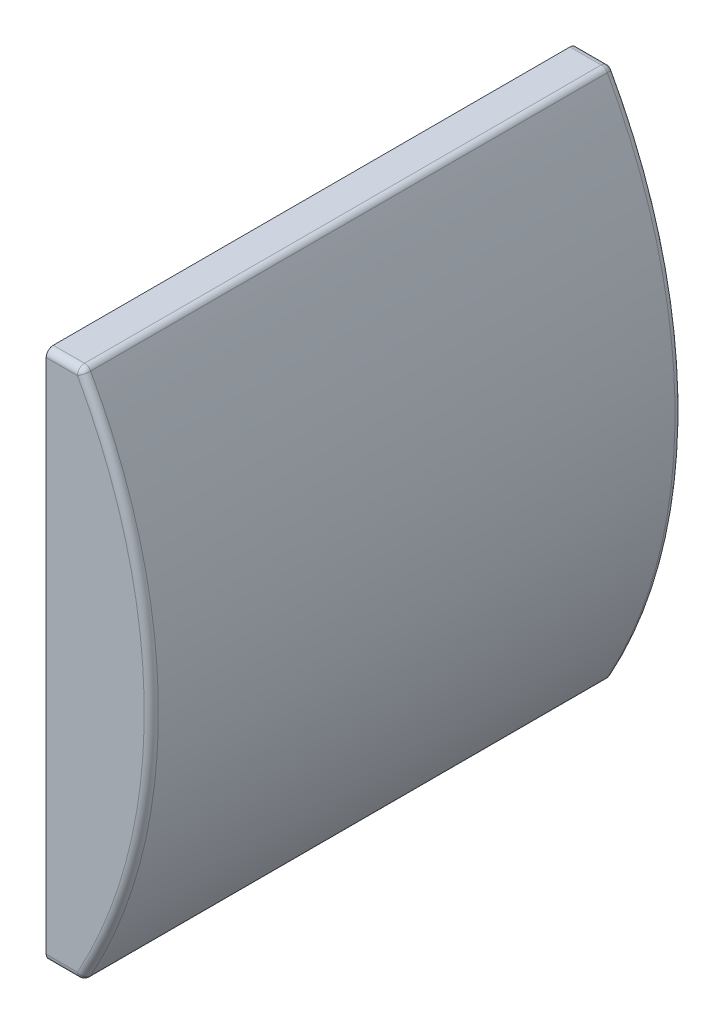
ISO-10303-21;
HEADER;
FILE_DESCRIPTION(('STEP AP214'),'2;1');
FILE_NAME('part.step','',(''),(''),'','','');
FILE_SCHEMA(('AUTOMOTIVE_DESIGN { 1 0 10303 214 1 1 1 1 }'));
ENDSEC;
DATA;
#1=APPLICATION_CONTEXT('core data for automotive mechanical design processes');
#2=APPLICATION_PROTOCOL_DEFINITION('international standard','automotive_design',2000,#1);
#3=PRODUCT_CONTEXT('',#1,'mechanical');
#4=PRODUCT('Part','Part','',(#3));
#5=PRODUCT_RELATED_PRODUCT_CATEGORY('part','',(#4));
#6=PRODUCT_DEFINITION_FORMATION('','',#4);
#7=PRODUCT_DEFINITION_CONTEXT('part definition',#1,'design');
#8=PRODUCT_DEFINITION('design','',#6,#7);
#9=PRODUCT_DEFINITION_SHAPE('','',#8);
#10=(LENGTH_UNIT() NAMED_UNIT(*) SI_UNIT(.MILLI.,.METRE.));
#11=(NAMED_UNIT(*) PLANE_ANGLE_UNIT() SI_UNIT($,.RADIAN.));
#12=(NAMED_UNIT(*) SI_UNIT($,.STERADIAN.) SOLID_ANGLE_UNIT());
#13=UNCERTAINTY_MEASURE_WITH_UNIT(LENGTH_MEASURE(1.E-05),#10,'distance_accuracy_value','');
#14=(GEOMETRIC_REPRESENTATION_CONTEXT(3) GLOBAL_UNCERTAINTY_ASSIGNED_CONTEXT((#13)) GLOBAL_UNIT_ASSIGNED_CONTEXT((#10,
#11,#12)) REPRESENTATION_CONTEXT('',''));
#15=CARTESIAN_POINT('',(0.,0.,0.));
#16=DIRECTION('',(0.,0.,1.));
#17=DIRECTION('',(1.,0.,0.));
#18=AXIS2_PLACEMENT_3D('',#15,#16,#17);
#19=CARTESIAN_POINT('',(0.,422.643442622951,750.));
#20=DIRECTION('',(0.,-1.,0.));
#21=DIRECTION('',(0.,0.,-1.));
#22=AXIS2_PLACEMENT_3D('',#19,#20,#21);
#23=PLANE('',#22);
#24=DIRECTION('',(0.,0.,-1.));
#25=VECTOR('',#24,1.);
#26=CARTESIAN_POINT('',(44.1359559737445,422.643442622951,750.));
#27=LINE('',#26,#25);
#28=CARTESIAN_POINT('',(44.1359559737445,422.643442622951,740.));
#29=VERTEX_POINT('',#28);
#30=CARTESIAN_POINT('',(44.1359559737445,422.643442622951,10.));
#31=VERTEX_POINT('',#30);
#32=EDGE_CURVE('E151',#29,#31,#27,.T.);
#33=ORIENTED_EDGE('',*,*,#32,.T.);
#34=DIRECTION('',(-1.,0.,0.));
#35=VECTOR('',#34,1.);
#36=CARTESIAN_POINT('',(0.,422.643442622951,10.));
#37=LINE('',#36,#35);
#38=CARTESIAN_POINT('',(0.,422.643442622951,10.));
#39=VERTEX_POINT('',#38);
#40=EDGE_CURVE('E158',#31,#39,#37,.T.);
#41=ORIENTED_EDGE('',*,*,#40,.T.);
#42=DIRECTION('',(0.,0.,-1.));
#43=VECTOR('',#42,1.);
#44=CARTESIAN_POINT('',(0.,422.643442622951,750.));
#45=LINE('',#44,#43);
#46=CARTESIAN_POINT('',(0.,422.643442622951,740.));
#47=VERTEX_POINT('',#46);
#48=EDGE_CURVE('E127',#47,#39,#45,.T.);
#49=ORIENTED_EDGE('',*,*,#48,.F.);
#50=DIRECTION('',(-1.,0.,0.));
#51=VECTOR('',#50,1.);
#52=CARTESIAN_POINT('',(38.4921684074177,422.643442622951,740.));
#53=LINE('',#52,#51);
#54=EDGE_CURVE('E138',#47,#29,#53,.F.);
#55=ORIENTED_EDGE('',*,*,#54,.T.);
#56=EDGE_LOOP('',(#33,#41,#49,#55));
#57=FACE_BOUND('',#56,.T.);
#58=ADVANCED_FACE('F37',(#57),#23,.F.);
#59=CARTESIAN_POINT('',(0.,422.643442622951,750.));
#60=DIRECTION('',(1.,0.,0.));
#61=DIRECTION('',(0.,0.,-1.));
#62=AXIS2_PLACEMENT_3D('',#59,#60,#61);
#63=PLANE('',#62);
#64=DIRECTION('',(0.,0.,-1.));
#65=VECTOR('',#64,1.);
#66=CARTESIAN_POINT('',(0.,-327.356557377049,750.));
#67=LINE('',#66,#65);
#68=CARTESIAN_POINT('',(0.,-327.356557377049,740.));
#69=VERTEX_POINT('',#68);
#70=CARTESIAN_POINT('',(0.,-327.356557377049,10.));
#71=VERTEX_POINT('',#70);
#72=EDGE_CURVE('E224',#69,#71,#67,.T.);
#73=ORIENTED_EDGE('',*,*,#72,.F.);
#74=CARTESIAN_POINT('',(0.,-317.356557377049,740.));
#75=DIRECTION('',(1.,0.,0.));
#76=DIRECTION('',(0.,0.,-1.));
#77=AXIS2_PLACEMENT_3D('',#74,#75,#76);
#78=CIRCLE('',#77,10.);
#79=CARTESIAN_POINT('',(0.,-317.356557377049,750.));
#80=VERTEX_POINT('',#79);
#81=EDGE_CURVE('E188',#69,#80,#78,.F.);
#82=ORIENTED_EDGE('',*,*,#81,.T.);
#83=DIRECTION('',(0.,-1.,0.));
#84=VECTOR('',#83,1.);
#85=CARTESIAN_POINT('',(0.,422.643442622951,750.));
#86=LINE('',#85,#84);
#87=CARTESIAN_POINT('',(0.,412.643442622951,750.));
#88=VERTEX_POINT('',#87);
#89=EDGE_CURVE('E222',#88,#80,#86,.T.);
#90=ORIENTED_EDGE('',*,*,#89,.F.);
#91=CARTESIAN_POINT('',(0.,412.643442622951,740.));
#92=DIRECTION('',(1.,0.,0.));
#93=DIRECTION('',(0.,0.,-1.));
#94=AXIS2_PLACEMENT_3D('',#91,#92,#93);
#95=CIRCLE('',#94,10.);
#96=EDGE_CURVE('E149',#88,#47,#95,.F.);
#97=ORIENTED_EDGE('',*,*,#96,.T.);
#98=ORIENTED_EDGE('',*,*,#48,.T.);
#99=CARTESIAN_POINT('',(0.,412.643442622951,10.));
#100=DIRECTION('',(1.,0.,0.));
#101=DIRECTION('',(0.,0.,-1.));
#102=AXIS2_PLACEMENT_3D('',#99,#100,#101);
#103=CIRCLE('',#102,10.);
#104=CARTESIAN_POINT('',(0.,412.643442622951,0.));
#105=VERTEX_POINT('',#104);
#106=EDGE_CURVE('E164',#39,#105,#103,.F.);
#107=ORIENTED_EDGE('',*,*,#106,.T.);
#108=DIRECTION('',(0.,-1.,0.));
#109=VECTOR('',#108,1.);
#110=CARTESIAN_POINT('',(0.,422.643442622951,0.));
#111=LINE('',#110,#109);
#112=CARTESIAN_POINT('',(0.,-317.356557377049,0.));
#113=VERTEX_POINT('',#112);
#114=EDGE_CURVE('E161',#105,#113,#111,.T.);
#115=ORIENTED_EDGE('',*,*,#114,.T.);
#116=CARTESIAN_POINT('',(0.,-317.356557377049,10.));
#117=DIRECTION('',(1.,0.,0.));
#118=DIRECTION('',(0.,0.,-1.));
#119=AXIS2_PLACEMENT_3D('',#116,#117,#118);
#120=CIRCLE('',#119,10.);
#121=EDGE_CURVE('E186',#113,#71,#120,.F.);
#122=ORIENTED_EDGE('',*,*,#121,.T.);
#123=EDGE_LOOP('',(#73,#82,#90,#97,#98,#107,#115,#122));
#124=FACE_BOUND('',#123,.T.);
#125=ADVANCED_FACE('F219',(#124),#63,.F.);
#126=CARTESIAN_POINT('',(0.,-327.356557377049,750.));
#127=DIRECTION('',(0.,1.,0.));
#128=DIRECTION('',(0.,0.,1.));
#129=AXIS2_PLACEMENT_3D('',#126,#127,#128);
#130=PLANE('',#129);
#131=DIRECTION('',(0.,0.,-1.));
#132=VECTOR('',#131,1.);
#133=CARTESIAN_POINT('',(44.1359559737444,-327.356557377049,750.));
#134=LINE('',#133,#132);
#135=CARTESIAN_POINT('',(44.1359559737444,-327.356557377049,10.));
#136=VERTEX_POINT('',#135);
#137=CARTESIAN_POINT('',(44.1359559737444,-327.356557377049,740.));
#138=VERTEX_POINT('',#137);
#139=EDGE_CURVE('E180',#136,#138,#134,.F.);
#140=ORIENTED_EDGE('',*,*,#139,.T.);
#141=DIRECTION('',(1.,0.,0.));
#142=VECTOR('',#141,1.);
#143=CARTESIAN_POINT('',(0.,-327.356557377049,740.));
#144=LINE('',#143,#142);
#145=EDGE_CURVE('E184',#138,#69,#144,.F.);
#146=ORIENTED_EDGE('',*,*,#145,.T.);
#147=ORIENTED_EDGE('',*,*,#72,.T.);
#148=DIRECTION('',(1.,0.,0.));
#149=VECTOR('',#148,1.);
#150=CARTESIAN_POINT('',(0.,-327.356557377049,10.));
#151=LINE('',#150,#149);
#152=EDGE_CURVE('E182',#71,#136,#151,.T.);
#153=ORIENTED_EDGE('',*,*,#152,.T.);
#154=EDGE_LOOP('',(#140,#146,#147,#153));
#155=FACE_BOUND('',#154,.T.);
#156=ADVANCED_FACE('F255',(#155),#130,.F.);
#157=CARTESIAN_POINT('',(-614.274043583587,47.643442622951,750.));
#158=DIRECTION('',(0.,0.,-1.));
#159=DIRECTION('',(-1.,0.,0.));
#160=AXIS2_PLACEMENT_3D('',#157,#158,#159);
#161=CYLINDRICAL_SURFACE('',#160,762.813873090211);
#162=CARTESIAN_POINT('',(-614.274043583587,47.643442622951,740.));
#163=DIRECTION('',(0.,0.,1.));
#164=DIRECTION('',(1.,0.,0.));
#165=AXIS2_PLACEMENT_3D('',#162,#163,#164);
#166=CIRCLE('',#165,762.813873090211);
#167=CARTESIAN_POINT('',(52.8819425063072,417.491918628072,740.));
#168=VERTEX_POINT('',#167);
#169=CARTESIAN_POINT('',(52.8819425063071,-322.20503338217,740.));
#170=VERTEX_POINT('',#169);
#171=EDGE_CURVE('E126',#168,#170,#166,.F.);
#172=ORIENTED_EDGE('',*,*,#171,.T.);
#173=DIRECTION('',(0.,0.,-1.));
#174=VECTOR('',#173,1.);
#175=CARTESIAN_POINT('',(52.8819425063071,-322.20503338217,750.));
#176=LINE('',#175,#174);
#177=CARTESIAN_POINT('',(52.8819425063071,-322.20503338217,10.));
#178=VERTEX_POINT('',#177);
#179=EDGE_CURVE('E11',#170,#178,#176,.T.);
#180=ORIENTED_EDGE('',*,*,#179,.T.);
#181=CARTESIAN_POINT('',(-614.274043583587,47.643442622951,10.));
#182=DIRECTION('',(0.,0.,1.));
#183=DIRECTION('',(1.,0.,0.));
#184=AXIS2_PLACEMENT_3D('',#181,#182,#183);
#185=CIRCLE('',#184,762.813873090211);
#186=CARTESIAN_POINT('',(52.8819425063072,417.491918628072,10.));
#187=VERTEX_POINT('',#186);
#188=EDGE_CURVE('E172',#178,#187,#185,.T.);
#189=ORIENTED_EDGE('',*,*,#188,.T.);
#190=DIRECTION('',(0.,0.,-1.));
#191=VECTOR('',#190,1.);
#192=CARTESIAN_POINT('',(52.8819425063072,417.491918628072,750.));
#193=LINE('',#192,#191);
#194=EDGE_CURVE('E137',#187,#168,#193,.F.);
#195=ORIENTED_EDGE('',*,*,#194,.T.);
#196=EDGE_LOOP('',(#172,#180,#189,#195));
#197=FACE_BOUND('',#196,.T.);
#198=ADVANCED_FACE('F243',(#197),#161,.T.);
#199=CARTESIAN_POINT('',(-614.274043583587,47.643442622951,750.));
#200=DIRECTION('',(0.,0.,1.));
#201=DIRECTION('',(1.,0.,0.));
#202=AXIS2_PLACEMENT_3D('',#199,#200,#201);
#203=PLANE('',#202);
#204=ORIENTED_EDGE('',*,*,#89,.T.);
#205=DIRECTION('',(1.,0.,0.));
#206=VECTOR('',#205,1.);
#207=CARTESIAN_POINT('',(38.4921684074175,-317.356557377049,750.));
#208=LINE('',#207,#206);
#209=CARTESIAN_POINT('',(44.1359559737443,-317.356557377049,750.));
#210=VERTEX_POINT('',#209);
#211=EDGE_CURVE('E124',#80,#210,#208,.T.);
#212=ORIENTED_EDGE('',*,*,#211,.T.);
#213=CARTESIAN_POINT('',(-614.274043583587,47.643442622951,750.));
#214=DIRECTION('',(0.,0.,1.));
#215=DIRECTION('',(1.,0.,0.));
#216=AXIS2_PLACEMENT_3D('',#213,#214,#215);
#217=CIRCLE('',#216,752.813873090211);
#218=CARTESIAN_POINT('',(44.1359559737444,412.643442622951,750.));
#219=VERTEX_POINT('',#218);
#220=EDGE_CURVE('E116',#210,#219,#217,.T.);
#221=ORIENTED_EDGE('',*,*,#220,.T.);
#222=DIRECTION('',(-1.,0.,0.));
#223=VECTOR('',#222,1.);
#224=CARTESIAN_POINT('',(0.,412.643442622951,750.));
#225=LINE('',#224,#223);
#226=EDGE_CURVE('E121',#219,#88,#225,.T.);
#227=ORIENTED_EDGE('',*,*,#226,.T.);
#228=EDGE_LOOP('',(#204,#212,#221,#227));
#229=FACE_BOUND('',#228,.T.);
#230=ADVANCED_FACE('F119',(#229),#203,.T.);
#231=CARTESIAN_POINT('',(-614.274043583587,47.643442622951,0.));
#232=DIRECTION('',(0.,0.,1.));
#233=DIRECTION('',(1.,0.,0.));
#234=AXIS2_PLACEMENT_3D('',#231,#232,#233);
#235=PLANE('',#234);
#236=CARTESIAN_POINT('',(-614.274043583587,47.643442622951,0.));
#237=DIRECTION('',(0.,0.,1.));
#238=DIRECTION('',(1.,0.,0.));
#239=AXIS2_PLACEMENT_3D('',#236,#237,#238);
#240=CIRCLE('',#239,752.813873090211);
#241=CARTESIAN_POINT('',(44.1359559737444,412.643442622951,0.));
#242=VERTEX_POINT('',#241);
#243=CARTESIAN_POINT('',(44.1359559737444,-317.356557377049,0.));
#244=VERTEX_POINT('',#243);
#245=EDGE_CURVE('E166',#242,#244,#240,.F.);
#246=ORIENTED_EDGE('',*,*,#245,.T.);
#247=DIRECTION('',(1.,0.,0.));
#248=VECTOR('',#247,1.);
#249=CARTESIAN_POINT('',(-614.274043583587,-317.356557377049,0.));
#250=LINE('',#249,#248);
#251=EDGE_CURVE('E192',#244,#113,#250,.F.);
#252=ORIENTED_EDGE('',*,*,#251,.T.);
#253=ORIENTED_EDGE('',*,*,#114,.F.);
#254=DIRECTION('',(-1.,0.,0.));
#255=VECTOR('',#254,1.);
#256=CARTESIAN_POINT('',(-614.274043583587,412.643442622951,0.));
#257=LINE('',#256,#255);
#258=EDGE_CURVE('E168',#105,#242,#257,.F.);
#259=ORIENTED_EDGE('',*,*,#258,.T.);
#260=EDGE_LOOP('',(#246,#252,#253,#259));
#261=FACE_BOUND('',#260,.T.);
#262=ADVANCED_FACE('F215',(#261),#235,.F.);
#263=CARTESIAN_POINT('',(-614.274043583587,47.643442622951,740.));
#264=DIRECTION('',(0.,0.,1.));
#265=DIRECTION('',(1.,0.,0.));
#266=AXIS2_PLACEMENT_3D('',#263,#264,#265);
#267=TOROIDAL_SURFACE('',#266,752.813873090211,10.);
#268=ORIENTED_EDGE('',*,*,#220,.F.);
#269=CARTESIAN_POINT('',(44.1359559737444,-317.356557377049,740.));
#270=DIRECTION('',(0.484847600512087,0.874598653256264,0.));
#271=DIRECTION('',(-0.874598653256264,0.484847600512087,0.));
#272=AXIS2_PLACEMENT_3D('',#269,#270,#271);
#273=CIRCLE('',#272,10.);
#274=EDGE_CURVE('E190',#210,#170,#273,.T.);
#275=ORIENTED_EDGE('',*,*,#274,.T.);
#276=ORIENTED_EDGE('',*,*,#171,.F.);
#277=CARTESIAN_POINT('',(44.1359559737444,412.643442622951,740.));
#278=DIRECTION('',(-0.484847600512087,0.874598653256264,0.));
#279=DIRECTION('',(-0.874598653256264,-0.484847600512087,0.));
#280=AXIS2_PLACEMENT_3D('',#277,#278,#279);
#281=CIRCLE('',#280,10.);
#282=EDGE_CURVE('E131',#168,#219,#281,.F.);
#283=ORIENTED_EDGE('',*,*,#282,.T.);
#284=EDGE_LOOP('',(#268,#275,#276,#283));
#285=FACE_BOUND('',#284,.T.);
#286=ADVANCED_FACE('F133',(#285),#267,.T.);
#287=CARTESIAN_POINT('',(44.1359559737445,412.643442622951,750.));
#288=DIRECTION('',(0.,0.,-1.));
#289=DIRECTION('',(-1.,0.,0.));
#290=AXIS2_PLACEMENT_3D('',#287,#288,#289);
#291=CYLINDRICAL_SURFACE('',#290,10.);
#292=ORIENTED_EDGE('',*,*,#194,.F.);
#293=CARTESIAN_POINT('',(44.1359559737445,412.643442622951,10.));
#294=DIRECTION('',(0.,0.,-1.));
#295=DIRECTION('',(-1.,0.,0.));
#296=AXIS2_PLACEMENT_3D('',#293,#294,#295);
#297=CIRCLE('',#296,10.);
#298=EDGE_CURVE('E170',#187,#31,#297,.F.);
#299=ORIENTED_EDGE('',*,*,#298,.T.);
#300=ORIENTED_EDGE('',*,*,#32,.F.);
#301=CARTESIAN_POINT('',(44.1359559737445,412.643442622951,740.));
#302=DIRECTION('',(0.,0.,1.));
#303=DIRECTION('',(1.,0.,0.));
#304=AXIS2_PLACEMENT_3D('',#301,#302,#303);
#305=CIRCLE('',#304,10.);
#306=EDGE_CURVE('E143',#168,#29,#305,.T.);
#307=ORIENTED_EDGE('',*,*,#306,.F.);
#308=EDGE_LOOP('',(#292,#299,#300,#307));
#309=FACE_BOUND('',#308,.T.);
#310=ADVANCED_FACE('F242',(#309),#291,.T.);
#311=CARTESIAN_POINT('',(44.1359559737445,412.643442622951,740.));
#312=DIRECTION('',(0.,-1.,0.));
#313=DIRECTION('',(0.,0.,-1.));
#314=AXIS2_PLACEMENT_3D('',#311,#312,#313);
#315=SPHERICAL_SURFACE('',#314,10.);
#316=ORIENTED_EDGE('',*,*,#282,.F.);
#317=ORIENTED_EDGE('',*,*,#306,.T.);
#318=CARTESIAN_POINT('',(44.1359559737445,412.643442622951,740.));
#319=DIRECTION('',(-1.,0.,0.));
#320=DIRECTION('',(0.,-1.,0.));
#321=AXIS2_PLACEMENT_3D('',#318,#319,#320);
#322=CIRCLE('',#321,10.);
#323=EDGE_CURVE('E141',#219,#29,#322,.T.);
#324=ORIENTED_EDGE('',*,*,#323,.F.);
#325=EDGE_LOOP('',(#316,#317,#324));
#326=FACE_BOUND('',#325,.T.);
#327=ADVANCED_FACE('F142',(#326),#315,.T.);
#328=CARTESIAN_POINT('',(-614.274043583587,412.643442622951,740.));
#329=DIRECTION('',(1.,0.,0.));
#330=DIRECTION('',(0.,0.,-1.));
#331=AXIS2_PLACEMENT_3D('',#328,#329,#330);
#332=CYLINDRICAL_SURFACE('',#331,10.);
#333=ORIENTED_EDGE('',*,*,#323,.T.);
#334=ORIENTED_EDGE('',*,*,#54,.F.);
#335=ORIENTED_EDGE('',*,*,#96,.F.);
#336=ORIENTED_EDGE('',*,*,#226,.F.);
#337=EDGE_LOOP('',(#333,#334,#335,#336));
#338=FACE_BOUND('',#337,.T.);
#339=ADVANCED_FACE('F148',(#338),#332,.T.);
#340=CARTESIAN_POINT('',(-614.274043583587,47.643442622951,10.));
#341=DIRECTION('',(0.,0.,1.));
#342=DIRECTION('',(1.,0.,0.));
#343=AXIS2_PLACEMENT_3D('',#340,#341,#342);
#344=TOROIDAL_SURFACE('',#343,752.813873090211,10.);
#345=ORIENTED_EDGE('',*,*,#188,.F.);
#346=CARTESIAN_POINT('',(44.1359559737444,-317.356557377049,10.));
#347=DIRECTION('',(0.484847600512087,0.874598653256264,0.));
#348=DIRECTION('',(-0.874598653256264,0.484847600512087,0.));
#349=AXIS2_PLACEMENT_3D('',#346,#347,#348);
#350=CIRCLE('',#349,10.);
#351=EDGE_CURVE('E46',#178,#244,#350,.T.);
#352=ORIENTED_EDGE('',*,*,#351,.T.);
#353=ORIENTED_EDGE('',*,*,#245,.F.);
#354=CARTESIAN_POINT('',(44.1359559737446,412.643442622951,10.));
#355=DIRECTION('',(-0.484847600512089,0.874598653256263,0.));
#356=DIRECTION('',(-0.874598653256264,-0.484847600512089,0.));
#357=AXIS2_PLACEMENT_3D('',#354,#355,#356);
#358=CIRCLE('',#357,10.);
#359=EDGE_CURVE('E146',#187,#242,#358,.T.);
#360=ORIENTED_EDGE('',*,*,#359,.F.);
#361=EDGE_LOOP('',(#345,#352,#353,#360));
#362=FACE_BOUND('',#361,.T.);
#363=ADVANCED_FACE('F236',(#362),#344,.T.);
#364=CARTESIAN_POINT('',(44.1359559737445,412.643442622951,10.));
#365=DIRECTION('',(0.,0.,1.));
#366=DIRECTION('',(1.,0.,0.));
#367=AXIS2_PLACEMENT_3D('',#364,#365,#366);
#368=SPHERICAL_SURFACE('',#367,10.);
#369=ORIENTED_EDGE('',*,*,#298,.F.);
#370=ORIENTED_EDGE('',*,*,#359,.T.);
#371=CARTESIAN_POINT('',(44.1359559737445,412.643442622951,10.));
#372=DIRECTION('',(-1.,0.,0.));
#373=DIRECTION('',(0.,0.,1.));
#374=AXIS2_PLACEMENT_3D('',#371,#372,#373);
#375=CIRCLE('',#374,10.);
#376=EDGE_CURVE('E174',#31,#242,#375,.T.);
#377=ORIENTED_EDGE('',*,*,#376,.F.);
#378=EDGE_LOOP('',(#369,#370,#377));
#379=FACE_BOUND('',#378,.T.);
#380=ADVANCED_FACE('F239',(#379),#368,.T.);
#381=CARTESIAN_POINT('',(0.,412.643442622951,10.));
#382=DIRECTION('',(-1.,0.,0.));
#383=DIRECTION('',(0.,0.,1.));
#384=AXIS2_PLACEMENT_3D('',#381,#382,#383);
#385=CYLINDRICAL_SURFACE('',#384,10.);
#386=ORIENTED_EDGE('',*,*,#376,.T.);
#387=ORIENTED_EDGE('',*,*,#258,.F.);
#388=ORIENTED_EDGE('',*,*,#106,.F.);
#389=ORIENTED_EDGE('',*,*,#40,.F.);
#390=EDGE_LOOP('',(#386,#387,#388,#389));
#391=FACE_BOUND('',#390,.T.);
#392=ADVANCED_FACE('F234',(#391),#385,.T.);
#393=CARTESIAN_POINT('',(0.,-317.356557377049,10.));
#394=DIRECTION('',(1.,0.,0.));
#395=DIRECTION('',(0.,0.,-1.));
#396=AXIS2_PLACEMENT_3D('',#393,#394,#395);
#397=CYLINDRICAL_SURFACE('',#396,10.);
#398=ORIENTED_EDGE('',*,*,#121,.F.);
#399=ORIENTED_EDGE('',*,*,#251,.F.);
#400=CARTESIAN_POINT('',(44.1359559737445,-317.356557377049,10.));
#401=DIRECTION('',(1.,0.,0.));
#402=DIRECTION('',(0.,0.,-1.));
#403=AXIS2_PLACEMENT_3D('',#400,#401,#402);
#404=CIRCLE('',#403,10.);
#405=EDGE_CURVE('E41',#136,#244,#404,.T.);
#406=ORIENTED_EDGE('',*,*,#405,.F.);
#407=ORIENTED_EDGE('',*,*,#152,.F.);
#408=EDGE_LOOP('',(#398,#399,#406,#407));
#409=FACE_BOUND('',#408,.T.);
#410=ADVANCED_FACE('F39',(#409),#397,.T.);
#411=CARTESIAN_POINT('',(44.1359559737444,-317.356557377049,10.));
#412=DIRECTION('',(0.,1.,0.));
#413=DIRECTION('',(0.,0.,1.));
#414=AXIS2_PLACEMENT_3D('',#411,#412,#413);
#415=SPHERICAL_SURFACE('',#414,10.);
#416=ORIENTED_EDGE('',*,*,#405,.T.);
#417=ORIENTED_EDGE('',*,*,#351,.F.);
#418=CARTESIAN_POINT('',(44.1359559737444,-317.356557377049,10.));
#419=DIRECTION('',(0.,0.,1.));
#420=DIRECTION('',(1.,0.,0.));
#421=AXIS2_PLACEMENT_3D('',#418,#419,#420);
#422=CIRCLE('',#421,10.);
#423=EDGE_CURVE('E199',#136,#178,#422,.T.);
#424=ORIENTED_EDGE('',*,*,#423,.F.);
#425=EDGE_LOOP('',(#416,#417,#424));
#426=FACE_BOUND('',#425,.T.);
#427=ADVANCED_FACE('F207',(#426),#415,.T.);
#428=CARTESIAN_POINT('',(44.1359559737444,-317.356557377049,750.));
#429=DIRECTION('',(0.,0.,-1.));
#430=DIRECTION('',(-1.,0.,0.));
#431=AXIS2_PLACEMENT_3D('',#428,#429,#430);
#432=CYLINDRICAL_SURFACE('',#431,10.);
#433=ORIENTED_EDGE('',*,*,#423,.T.);
#434=ORIENTED_EDGE('',*,*,#179,.F.);
#435=CARTESIAN_POINT('',(44.1359559737444,-317.356557377049,740.));
#436=DIRECTION('',(0.,0.,1.));
#437=DIRECTION('',(1.,0.,0.));
#438=AXIS2_PLACEMENT_3D('',#435,#436,#437);
#439=CIRCLE('',#438,10.);
#440=EDGE_CURVE('E197',#138,#170,#439,.T.);
#441=ORIENTED_EDGE('',*,*,#440,.F.);
#442=ORIENTED_EDGE('',*,*,#139,.F.);
#443=EDGE_LOOP('',(#433,#434,#441,#442));
#444=FACE_BOUND('',#443,.T.);
#445=ADVANCED_FACE('F245',(#444),#432,.T.);
#446=CARTESIAN_POINT('',(44.1359559737444,-317.356557377049,740.));
#447=DIRECTION('',(0.,1.,0.));
#448=DIRECTION('',(0.,0.,1.));
#449=AXIS2_PLACEMENT_3D('',#446,#447,#448);
#450=SPHERICAL_SURFACE('',#449,10.);
#451=ORIENTED_EDGE('',*,*,#440,.T.);
#452=ORIENTED_EDGE('',*,*,#274,.F.);
#453=CARTESIAN_POINT('',(44.1359559737444,-317.356557377049,740.));
#454=DIRECTION('',(-1.,0.,0.));
#455=DIRECTION('',(0.,0.,1.));
#456=AXIS2_PLACEMENT_3D('',#453,#454,#455);
#457=CIRCLE('',#456,10.);
#458=EDGE_CURVE('E195',#138,#210,#457,.T.);
#459=ORIENTED_EDGE('',*,*,#458,.F.);
#460=EDGE_LOOP('',(#451,#452,#459));
#461=FACE_BOUND('',#460,.T.);
#462=ADVANCED_FACE('F250',(#461),#450,.T.);
#463=CARTESIAN_POINT('',(-614.274043583587,-317.356557377049,740.));
#464=DIRECTION('',(-1.,0.,0.));
#465=DIRECTION('',(0.,0.,1.));
#466=AXIS2_PLACEMENT_3D('',#463,#464,#465);
#467=CYLINDRICAL_SURFACE('',#466,10.);
#468=ORIENTED_EDGE('',*,*,#81,.F.);
#469=ORIENTED_EDGE('',*,*,#145,.F.);
#470=ORIENTED_EDGE('',*,*,#458,.T.);
#471=ORIENTED_EDGE('',*,*,#211,.F.);
#472=EDGE_LOOP('',(#468,#469,#470,#471));
#473=FACE_BOUND('',#472,.T.);
#474=ADVANCED_FACE('F253',(#473),#467,.T.);
#475=CLOSED_SHELL('',(#58,#125,#156,#198,#230,#262,#286,#310,#327,#339,#363,#380,#392,#410,#427,
#445,#462,#474));
#476=MANIFOLD_SOLID_BREP('B2',#475);
#477=ADVANCED_BREP_SHAPE_REPRESENTATION('',(#18,#476),#14);
#478=SHAPE_DEFINITION_REPRESENTATION(#9,#477);
ENDSEC;
END-ISO-10303-21;
